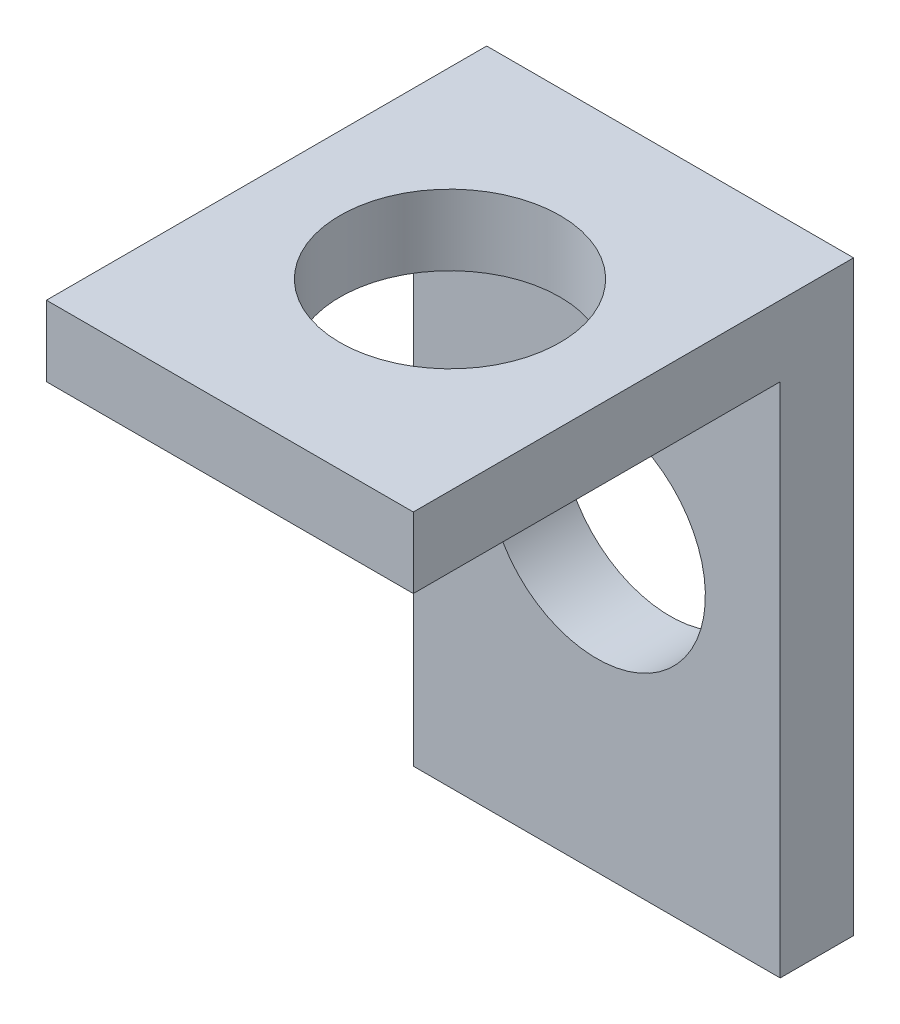
ISO-10303-21;
HEADER;
FILE_DESCRIPTION(('STEP AP214'),'2;1');
FILE_NAME('part.step','',(''),(''),'','','');
FILE_SCHEMA(('AUTOMOTIVE_DESIGN { 1 0 10303 214 1 1 1 1 }'));
ENDSEC;
DATA;
#1=APPLICATION_CONTEXT('core data for automotive mechanical design processes');
#2=APPLICATION_PROTOCOL_DEFINITION('international standard','automotive_design',2000,#1);
#3=PRODUCT_CONTEXT('',#1,'mechanical');
#4=PRODUCT('Part','Part','',(#3));
#5=PRODUCT_RELATED_PRODUCT_CATEGORY('part','',(#4));
#6=PRODUCT_DEFINITION_FORMATION('','',#4);
#7=PRODUCT_DEFINITION_CONTEXT('part definition',#1,'design');
#8=PRODUCT_DEFINITION('design','',#6,#7);
#9=PRODUCT_DEFINITION_SHAPE('','',#8);
#10=(LENGTH_UNIT() NAMED_UNIT(*) SI_UNIT(.MILLI.,.METRE.));
#11=(NAMED_UNIT(*) PLANE_ANGLE_UNIT() SI_UNIT($,.RADIAN.));
#12=(NAMED_UNIT(*) SI_UNIT($,.STERADIAN.) SOLID_ANGLE_UNIT());
#13=UNCERTAINTY_MEASURE_WITH_UNIT(LENGTH_MEASURE(1.E-05),#10,'distance_accuracy_value','');
#14=(GEOMETRIC_REPRESENTATION_CONTEXT(3) GLOBAL_UNCERTAINTY_ASSIGNED_CONTEXT((#13)) GLOBAL_UNIT_ASSIGNED_CONTEXT((#10,
#11,#12)) REPRESENTATION_CONTEXT('',''));
#15=CARTESIAN_POINT('',(0.,0.,0.));
#16=DIRECTION('',(0.,0.,1.));
#17=DIRECTION('',(1.,0.,0.));
#18=AXIS2_PLACEMENT_3D('',#15,#16,#17);
#19=CARTESIAN_POINT('',(6.35,0.,12.7));
#20=DIRECTION('',(0.,1.,0.));
#21=DIRECTION('',(0.,0.,1.));
#22=AXIS2_PLACEMENT_3D('',#19,#20,#21);
#23=PLANE('',#22);
#24=CARTESIAN_POINT('',(0.,0.,5.08));
#25=DIRECTION('',(0.,1.,0.));
#26=DIRECTION('',(0.,0.,1.));
#27=AXIS2_PLACEMENT_3D('',#24,#25,#26);
#28=CIRCLE('',#27,3.81);
#29=CARTESIAN_POINT('',(0.,0.,8.89));
#30=VERTEX_POINT('',#29);
#31=EDGE_CURVE('E160',#30,#30,#28,.T.);
#32=ORIENTED_EDGE('',*,*,#31,.T.);
#33=EDGE_LOOP('',(#32));
#34=FACE_BOUND('',#33,.T.);
#35=DIRECTION('',(0.,0.,-1.));
#36=VECTOR('',#35,1.);
#37=CARTESIAN_POINT('',(-6.35,0.,12.7));
#38=LINE('',#37,#36);
#39=CARTESIAN_POINT('',(-6.35,0.,12.7));
#40=VERTEX_POINT('',#39);
#41=CARTESIAN_POINT('',(-6.35,0.,0.));
#42=VERTEX_POINT('',#41);
#43=EDGE_CURVE('E116',#40,#42,#38,.T.);
#44=ORIENTED_EDGE('',*,*,#43,.T.);
#45=DIRECTION('',(-1.,0.,0.));
#46=VECTOR('',#45,1.);
#47=CARTESIAN_POINT('',(6.35,0.,0.));
#48=LINE('',#47,#46);
#49=CARTESIAN_POINT('',(6.35,0.,0.));
#50=VERTEX_POINT('',#49);
#51=EDGE_CURVE('E11',#50,#42,#48,.T.);
#52=ORIENTED_EDGE('',*,*,#51,.F.);
#53=DIRECTION('',(0.,0.,-1.));
#54=VECTOR('',#53,1.);
#55=CARTESIAN_POINT('',(6.35,0.,12.7));
#56=LINE('',#55,#54);
#57=CARTESIAN_POINT('',(6.35,0.,12.7));
#58=VERTEX_POINT('',#57);
#59=EDGE_CURVE('E127',#58,#50,#56,.T.);
#60=ORIENTED_EDGE('',*,*,#59,.F.);
#61=DIRECTION('',(-1.,0.,0.));
#62=VECTOR('',#61,1.);
#63=CARTESIAN_POINT('',(6.35,0.,12.7));
#64=LINE('',#63,#62);
#65=EDGE_CURVE('E112',#58,#40,#64,.T.);
#66=ORIENTED_EDGE('',*,*,#65,.T.);
#67=EDGE_LOOP('',(#44,#52,#60,#66));
#68=FACE_BOUND('',#67,.T.);
#69=ADVANCED_FACE('F32',(#34,#68),#23,.F.);
#70=CARTESIAN_POINT('',(6.35,0.,0.));
#71=DIRECTION('',(0.,0.,-1.));
#72=DIRECTION('',(0.,1.,0.));
#73=AXIS2_PLACEMENT_3D('',#70,#71,#72);
#74=PLANE('',#73);
#75=CARTESIAN_POINT('',(0.,-7.71452958200887,0.));
#76=DIRECTION('',(0.,0.,-1.));
#77=DIRECTION('',(0.,1.,0.));
#78=AXIS2_PLACEMENT_3D('',#75,#76,#77);
#79=CIRCLE('',#78,3.76011433734912);
#80=CARTESIAN_POINT('',(0.,-3.95441524465976,0.));
#81=VERTEX_POINT('',#80);
#82=EDGE_CURVE('E120',#81,#81,#79,.T.);
#83=ORIENTED_EDGE('',*,*,#82,.T.);
#84=EDGE_LOOP('',(#83));
#85=FACE_BOUND('',#84,.T.);
#86=DIRECTION('',(0.,-1.,0.));
#87=VECTOR('',#86,1.);
#88=CARTESIAN_POINT('',(-6.35,0.,0.));
#89=LINE('',#88,#87);
#90=CARTESIAN_POINT('',(-6.35,-17.8745295820089,0.));
#91=VERTEX_POINT('',#90);
#92=EDGE_CURVE('E119',#42,#91,#89,.T.);
#93=ORIENTED_EDGE('',*,*,#92,.T.);
#94=DIRECTION('',(-1.,0.,0.));
#95=VECTOR('',#94,1.);
#96=CARTESIAN_POINT('',(6.35,-17.8745295820089,0.));
#97=LINE('',#96,#95);
#98=CARTESIAN_POINT('',(6.35,-17.8745295820089,0.));
#99=VERTEX_POINT('',#98);
#100=EDGE_CURVE('E40',#99,#91,#97,.T.);
#101=ORIENTED_EDGE('',*,*,#100,.F.);
#102=DIRECTION('',(0.,-1.,0.));
#103=VECTOR('',#102,1.);
#104=CARTESIAN_POINT('',(6.35,0.,0.));
#105=LINE('',#104,#103);
#106=EDGE_CURVE('E85',#50,#99,#105,.T.);
#107=ORIENTED_EDGE('',*,*,#106,.F.);
#108=ORIENTED_EDGE('',*,*,#51,.T.);
#109=EDGE_LOOP('',(#93,#101,#107,#108));
#110=FACE_BOUND('',#109,.T.);
#111=ADVANCED_FACE('F152',(#85,#110),#74,.F.);
#112=CARTESIAN_POINT('',(6.35,-17.8745295820089,0.));
#113=DIRECTION('',(0.,1.,0.));
#114=DIRECTION('',(0.,0.,1.));
#115=AXIS2_PLACEMENT_3D('',#112,#113,#114);
#116=PLANE('',#115);
#117=DIRECTION('',(0.,0.,-1.));
#118=VECTOR('',#117,1.);
#119=CARTESIAN_POINT('',(-6.35,-17.8745295820089,0.));
#120=LINE('',#119,#118);
#121=CARTESIAN_POINT('',(-6.35,-17.8745295820089,-2.54));
#122=VERTEX_POINT('',#121);
#123=EDGE_CURVE('E122',#91,#122,#120,.T.);
#124=ORIENTED_EDGE('',*,*,#123,.T.);
#125=DIRECTION('',(-1.,0.,0.));
#126=VECTOR('',#125,1.);
#127=CARTESIAN_POINT('',(6.35,-17.8745295820089,-2.54));
#128=LINE('',#127,#126);
#129=CARTESIAN_POINT('',(6.35,-17.8745295820089,-2.54));
#130=VERTEX_POINT('',#129);
#131=EDGE_CURVE('E107',#130,#122,#128,.T.);
#132=ORIENTED_EDGE('',*,*,#131,.F.);
#133=DIRECTION('',(0.,0.,-1.));
#134=VECTOR('',#133,1.);
#135=CARTESIAN_POINT('',(6.35,-17.8745295820089,0.));
#136=LINE('',#135,#134);
#137=EDGE_CURVE('E98',#99,#130,#136,.T.);
#138=ORIENTED_EDGE('',*,*,#137,.F.);
#139=ORIENTED_EDGE('',*,*,#100,.T.);
#140=EDGE_LOOP('',(#124,#132,#138,#139));
#141=FACE_BOUND('',#140,.T.);
#142=ADVANCED_FACE('F133',(#141),#116,.F.);
#143=CARTESIAN_POINT('',(6.35,-17.8745295820089,-2.54));
#144=DIRECTION('',(0.,0.,1.));
#145=DIRECTION('',(1.,0.,0.));
#146=AXIS2_PLACEMENT_3D('',#143,#144,#145);
#147=PLANE('',#146);
#148=CARTESIAN_POINT('',(0.,-7.71452958200887,-2.54));
#149=DIRECTION('',(0.,0.,-1.));
#150=DIRECTION('',(-1.,0.,0.));
#151=AXIS2_PLACEMENT_3D('',#148,#149,#150);
#152=CIRCLE('',#151,3.76011433734912);
#153=CARTESIAN_POINT('',(-3.76011433734912,-7.71452958200887,-2.54));
#154=VERTEX_POINT('',#153);
#155=EDGE_CURVE('E162',#154,#154,#152,.T.);
#156=ORIENTED_EDGE('',*,*,#155,.F.);
#157=EDGE_LOOP('',(#156));
#158=FACE_BOUND('',#157,.T.);
#159=DIRECTION('',(0.,1.,0.));
#160=VECTOR('',#159,1.);
#161=CARTESIAN_POINT('',(-6.35,-17.8745295820089,-2.54));
#162=LINE('',#161,#160);
#163=CARTESIAN_POINT('',(-6.35,2.44547041799113,-2.54));
#164=VERTEX_POINT('',#163);
#165=EDGE_CURVE('E106',#122,#164,#162,.T.);
#166=ORIENTED_EDGE('',*,*,#165,.T.);
#167=DIRECTION('',(-1.,0.,0.));
#168=VECTOR('',#167,1.);
#169=CARTESIAN_POINT('',(6.35,2.44547041799113,-2.54));
#170=LINE('',#169,#168);
#171=CARTESIAN_POINT('',(6.35,2.44547041799113,-2.54));
#172=VERTEX_POINT('',#171);
#173=EDGE_CURVE('E103',#172,#164,#170,.T.);
#174=ORIENTED_EDGE('',*,*,#173,.F.);
#175=DIRECTION('',(0.,1.,0.));
#176=VECTOR('',#175,1.);
#177=CARTESIAN_POINT('',(6.35,-17.8745295820089,-2.54));
#178=LINE('',#177,#176);
#179=EDGE_CURVE('E92',#130,#172,#178,.T.);
#180=ORIENTED_EDGE('',*,*,#179,.F.);
#181=ORIENTED_EDGE('',*,*,#131,.T.);
#182=EDGE_LOOP('',(#166,#174,#180,#181));
#183=FACE_BOUND('',#182,.T.);
#184=ADVANCED_FACE('F104',(#158,#183),#147,.F.);
#185=CARTESIAN_POINT('',(6.35,2.44547041799113,12.7));
#186=DIRECTION('',(0.,-1.,0.));
#187=DIRECTION('',(0.,0.,-1.));
#188=AXIS2_PLACEMENT_3D('',#185,#186,#187);
#189=PLANE('',#188);
#190=CARTESIAN_POINT('',(0.,2.44547041799113,5.08));
#191=DIRECTION('',(0.,1.,0.));
#192=DIRECTION('',(0.,0.,1.));
#193=AXIS2_PLACEMENT_3D('',#190,#191,#192);
#194=CIRCLE('',#193,3.81);
#195=CARTESIAN_POINT('',(0.,2.44547041799113,8.89));
#196=VERTEX_POINT('',#195);
#197=EDGE_CURVE('E163',#196,#196,#194,.T.);
#198=ORIENTED_EDGE('',*,*,#197,.F.);
#199=EDGE_LOOP('',(#198));
#200=FACE_BOUND('',#199,.T.);
#201=DIRECTION('',(0.,0.,1.));
#202=VECTOR('',#201,1.);
#203=CARTESIAN_POINT('',(-6.35,2.44547041799113,12.7));
#204=LINE('',#203,#202);
#205=CARTESIAN_POINT('',(-6.35,2.44547041799113,12.7));
#206=VERTEX_POINT('',#205);
#207=EDGE_CURVE('E71',#164,#206,#204,.T.);
#208=ORIENTED_EDGE('',*,*,#207,.T.);
#209=DIRECTION('',(-1.,0.,0.));
#210=VECTOR('',#209,1.);
#211=CARTESIAN_POINT('',(6.35,2.44547041799113,12.7));
#212=LINE('',#211,#210);
#213=CARTESIAN_POINT('',(6.35,2.44547041799113,12.7));
#214=VERTEX_POINT('',#213);
#215=EDGE_CURVE('E108',#214,#206,#212,.T.);
#216=ORIENTED_EDGE('',*,*,#215,.F.);
#217=DIRECTION('',(0.,0.,1.));
#218=VECTOR('',#217,1.);
#219=CARTESIAN_POINT('',(6.35,2.44547041799113,12.7));
#220=LINE('',#219,#218);
#221=EDGE_CURVE('E96',#172,#214,#220,.T.);
#222=ORIENTED_EDGE('',*,*,#221,.F.);
#223=ORIENTED_EDGE('',*,*,#173,.T.);
#224=EDGE_LOOP('',(#208,#216,#222,#223));
#225=FACE_BOUND('',#224,.T.);
#226=ADVANCED_FACE('F110',(#200,#225),#189,.F.);
#227=CARTESIAN_POINT('',(6.35,2.44547041799113,12.7));
#228=DIRECTION('',(0.,0.,-1.));
#229=DIRECTION('',(-1.,0.,0.));
#230=AXIS2_PLACEMENT_3D('',#227,#228,#229);
#231=PLANE('',#230);
#232=DIRECTION('',(0.,-1.,0.));
#233=VECTOR('',#232,1.);
#234=CARTESIAN_POINT('',(-6.35,2.44547041799113,12.7));
#235=LINE('',#234,#233);
#236=EDGE_CURVE('E77',#206,#40,#235,.T.);
#237=ORIENTED_EDGE('',*,*,#236,.T.);
#238=ORIENTED_EDGE('',*,*,#65,.F.);
#239=DIRECTION('',(0.,-1.,0.));
#240=VECTOR('',#239,1.);
#241=CARTESIAN_POINT('',(6.35,2.44547041799113,12.7));
#242=LINE('',#241,#240);
#243=EDGE_CURVE('E48',#214,#58,#242,.T.);
#244=ORIENTED_EDGE('',*,*,#243,.F.);
#245=ORIENTED_EDGE('',*,*,#215,.T.);
#246=EDGE_LOOP('',(#237,#238,#244,#245));
#247=FACE_BOUND('',#246,.T.);
#248=ADVANCED_FACE('F140',(#247),#231,.F.);
#249=CARTESIAN_POINT('',(6.35,0.,0.));
#250=DIRECTION('',(-1.,0.,0.));
#251=DIRECTION('',(0.,0.,1.));
#252=AXIS2_PLACEMENT_3D('',#249,#250,#251);
#253=PLANE('',#252);
#254=ORIENTED_EDGE('',*,*,#59,.T.);
#255=ORIENTED_EDGE('',*,*,#106,.T.);
#256=ORIENTED_EDGE('',*,*,#137,.T.);
#257=ORIENTED_EDGE('',*,*,#179,.T.);
#258=ORIENTED_EDGE('',*,*,#221,.T.);
#259=ORIENTED_EDGE('',*,*,#243,.T.);
#260=EDGE_LOOP('',(#254,#255,#256,#257,#258,#259));
#261=FACE_BOUND('',#260,.T.);
#262=ADVANCED_FACE('F94',(#261),#253,.F.);
#263=CARTESIAN_POINT('',(-6.35,0.,0.));
#264=DIRECTION('',(-1.,0.,0.));
#265=DIRECTION('',(0.,0.,1.));
#266=AXIS2_PLACEMENT_3D('',#263,#264,#265);
#267=PLANE('',#266);
#268=ORIENTED_EDGE('',*,*,#43,.F.);
#269=ORIENTED_EDGE('',*,*,#236,.F.);
#270=ORIENTED_EDGE('',*,*,#207,.F.);
#271=ORIENTED_EDGE('',*,*,#165,.F.);
#272=ORIENTED_EDGE('',*,*,#123,.F.);
#273=ORIENTED_EDGE('',*,*,#92,.F.);
#274=EDGE_LOOP('',(#268,#269,#270,#271,#272,#273));
#275=FACE_BOUND('',#274,.T.);
#276=ADVANCED_FACE('F136',(#275),#267,.T.);
#277=CARTESIAN_POINT('',(0.,-7.71452958200887,10.16));
#278=DIRECTION('',(0.,0.,-1.));
#279=DIRECTION('',(-1.,0.,0.));
#280=AXIS2_PLACEMENT_3D('',#277,#278,#279);
#281=CYLINDRICAL_SURFACE('',#280,3.76011433734912);
#282=ORIENTED_EDGE('',*,*,#155,.T.);
#283=EDGE_LOOP('',(#282));
#284=FACE_BOUND('',#283,.T.);
#285=ORIENTED_EDGE('',*,*,#82,.F.);
#286=EDGE_LOOP('',(#285));
#287=FACE_BOUND('',#286,.T.);
#288=ADVANCED_FACE('F175',(#284,#287),#281,.F.);
#289=CARTESIAN_POINT('',(0.,-0.0945295820088724,5.08));
#290=DIRECTION('',(0.,1.,0.));
#291=DIRECTION('',(0.,0.,1.));
#292=AXIS2_PLACEMENT_3D('',#289,#290,#291);
#293=CYLINDRICAL_SURFACE('',#292,3.81);
#294=ORIENTED_EDGE('',*,*,#197,.T.);
#295=EDGE_LOOP('',(#294));
#296=FACE_BOUND('',#295,.T.);
#297=ORIENTED_EDGE('',*,*,#31,.F.);
#298=EDGE_LOOP('',(#297));
#299=FACE_BOUND('',#298,.T.);
#300=ADVANCED_FACE('F177',(#296,#299),#293,.F.);
#301=CLOSED_SHELL('',(#69,#111,#142,#184,#226,#248,#262,#276,#288,#300));
#302=MANIFOLD_SOLID_BREP('B2',#301);
#303=ADVANCED_BREP_SHAPE_REPRESENTATION('',(#18,#302),#14);
#304=SHAPE_DEFINITION_REPRESENTATION(#9,#303);
ENDSEC;
END-ISO-10303-21;
